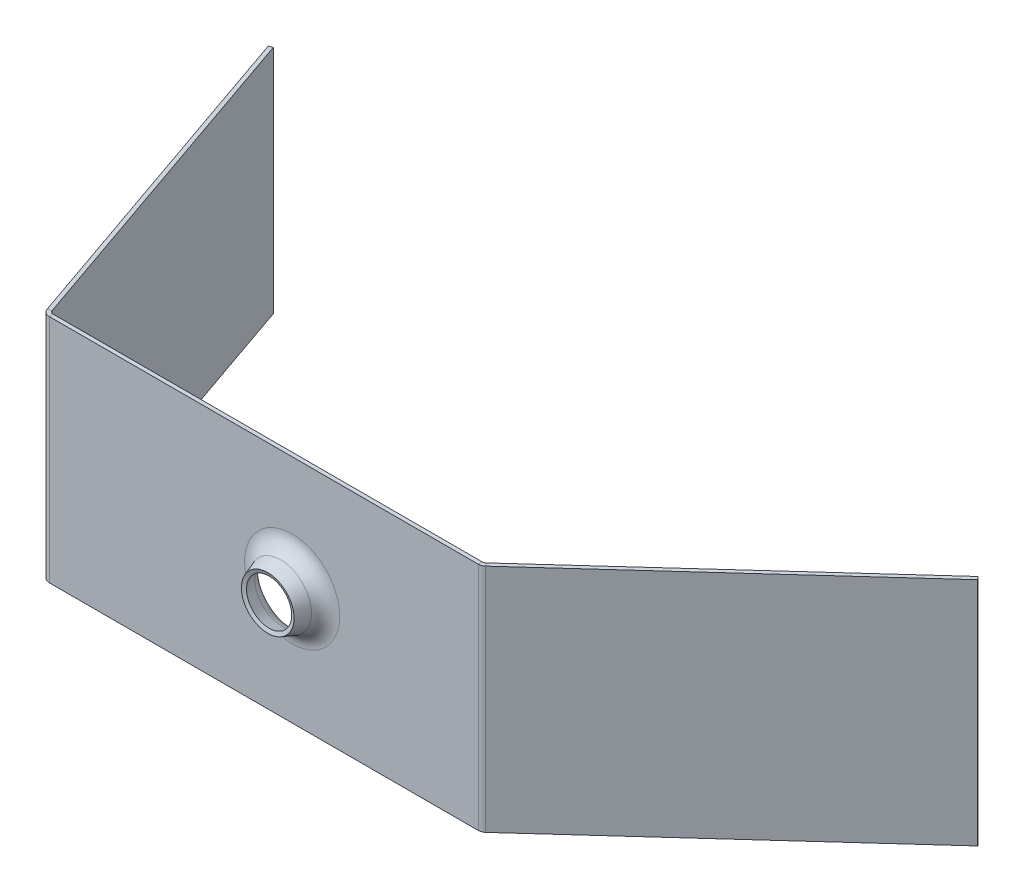
ISO-10303-21;
HEADER;
FILE_DESCRIPTION(('STEP AP214'),'2;1');
FILE_NAME('part.step','',(''),(''),'','','');
FILE_SCHEMA(('AUTOMOTIVE_DESIGN { 1 0 10303 214 1 1 1 1 }'));
ENDSEC;
DATA;
#1=APPLICATION_CONTEXT('core data for automotive mechanical design processes');
#2=APPLICATION_PROTOCOL_DEFINITION('international standard','automotive_design',2000,#1);
#3=PRODUCT_CONTEXT('',#1,'mechanical');
#4=PRODUCT('Part','Part','',(#3));
#5=PRODUCT_RELATED_PRODUCT_CATEGORY('part','',(#4));
#6=PRODUCT_DEFINITION_FORMATION('','',#4);
#7=PRODUCT_DEFINITION_CONTEXT('part definition',#1,'design');
#8=PRODUCT_DEFINITION('design','',#6,#7);
#9=PRODUCT_DEFINITION_SHAPE('','',#8);
#10=(LENGTH_UNIT() NAMED_UNIT(*) SI_UNIT(.MILLI.,.METRE.));
#11=(NAMED_UNIT(*) PLANE_ANGLE_UNIT() SI_UNIT($,.RADIAN.));
#12=(NAMED_UNIT(*) SI_UNIT($,.STERADIAN.) SOLID_ANGLE_UNIT());
#13=UNCERTAINTY_MEASURE_WITH_UNIT(LENGTH_MEASURE(1.E-05),#10,'distance_accuracy_value','');
#14=(GEOMETRIC_REPRESENTATION_CONTEXT(3) GLOBAL_UNCERTAINTY_ASSIGNED_CONTEXT((#13)) GLOBAL_UNIT_ASSIGNED_CONTEXT((#10,
#11,#12)) REPRESENTATION_CONTEXT('',''));
#15=CARTESIAN_POINT('',(0.,0.,0.));
#16=DIRECTION('',(0.,0.,1.));
#17=DIRECTION('',(1.,0.,0.));
#18=AXIS2_PLACEMENT_3D('',#15,#16,#17);
#19=CARTESIAN_POINT('',(0.,42.7,0.7366));
#20=DIRECTION('',(0.,0.,-1.));
#21=DIRECTION('',(-1.,0.,0.));
#22=AXIS2_PLACEMENT_3D('',#19,#20,#21);
#23=PLANE('',#22);
#24=DIRECTION('',(1.,0.,0.));
#25=VECTOR('',#24,1.);
#26=CARTESIAN_POINT('',(0.,0.,0.7366));
#27=LINE('',#26,#25);
#28=CARTESIAN_POINT('',(0.52431676148833,0.,0.7366));
#29=VERTEX_POINT('',#28);
#30=CARTESIAN_POINT('',(79.9649967682891,0.,0.736600000000012));
#31=VERTEX_POINT('',#30);
#32=EDGE_CURVE('E202',#29,#31,#27,.T.);
#33=ORIENTED_EDGE('',*,*,#32,.T.);
#34=DIRECTION('',(0.,-1.,0.));
#35=VECTOR('',#34,1.);
#36=CARTESIAN_POINT('',(79.9649967682891,42.7,0.736600000000012));
#37=LINE('',#36,#35);
#38=CARTESIAN_POINT('',(79.9649967682891,42.7,0.736600000000012));
#39=VERTEX_POINT('',#38);
#40=EDGE_CURVE('E164',#39,#31,#37,.T.);
#41=ORIENTED_EDGE('',*,*,#40,.F.);
#42=DIRECTION('',(1.,0.,0.));
#43=VECTOR('',#42,1.);
#44=CARTESIAN_POINT('',(0.,42.7,0.7366));
#45=LINE('',#44,#43);
#46=CARTESIAN_POINT('',(0.52431676148833,42.7,0.7366));
#47=VERTEX_POINT('',#46);
#48=EDGE_CURVE('E139',#47,#39,#45,.T.);
#49=ORIENTED_EDGE('',*,*,#48,.F.);
#50=DIRECTION('',(0.,-1.,0.));
#51=VECTOR('',#50,1.);
#52=CARTESIAN_POINT('',(0.52431676148833,42.7,0.7366));
#53=LINE('',#52,#51);
#54=EDGE_CURVE('E158',#47,#29,#53,.T.);
#55=ORIENTED_EDGE('',*,*,#54,.T.);
#56=EDGE_LOOP('',(#33,#41,#49,#55));
#57=FACE_BOUND('',#56,.T.);
#58=CARTESIAN_POINT('',(45.4934012407193,21.5147863199832,0.7366));
#59=DIRECTION('',(0.,0.,1.));
#60=DIRECTION('',(1.,0.,0.));
#61=AXIS2_PLACEMENT_3D('',#58,#59,#60);
#62=CIRCLE('',#61,8.80083015283884);
#63=CARTESIAN_POINT('',(54.2942313935582,21.5147863199832,0.7366));
#64=VERTEX_POINT('',#63);
#65=EDGE_CURVE('E11',#64,#64,#62,.T.);
#66=ORIENTED_EDGE('',*,*,#65,.F.);
#67=EDGE_LOOP('',(#66));
#68=FACE_BOUND('',#67,.T.);
#69=ADVANCED_FACE('F37',(#57,#68),#23,.F.);
#70=CARTESIAN_POINT('',(0.,42.7,0.));
#71=DIRECTION('',(0.,0.,-1.));
#72=DIRECTION('',(-1.,0.,0.));
#73=AXIS2_PLACEMENT_3D('',#70,#71,#72);
#74=PLANE('',#73);
#75=DIRECTION('',(1.,0.,0.));
#76=VECTOR('',#75,1.);
#77=CARTESIAN_POINT('',(0.,0.,0.));
#78=LINE('',#77,#76);
#79=CARTESIAN_POINT('',(0.52431676148833,0.,0.));
#80=VERTEX_POINT('',#79);
#81=CARTESIAN_POINT('',(79.9649967682891,0.,0.));
#82=VERTEX_POINT('',#81);
#83=EDGE_CURVE('E187',#80,#82,#78,.T.);
#84=ORIENTED_EDGE('',*,*,#83,.F.);
#85=DIRECTION('',(0.,-1.,0.));
#86=VECTOR('',#85,1.);
#87=CARTESIAN_POINT('',(0.52431676148833,42.7,0.));
#88=LINE('',#87,#86);
#89=CARTESIAN_POINT('',(0.52431676148833,42.7,0.));
#90=VERTEX_POINT('',#89);
#91=EDGE_CURVE('E217',#90,#80,#88,.T.);
#92=ORIENTED_EDGE('',*,*,#91,.F.);
#93=DIRECTION('',(1.,0.,0.));
#94=VECTOR('',#93,1.);
#95=CARTESIAN_POINT('',(0.,42.7,0.));
#96=LINE('',#95,#94);
#97=CARTESIAN_POINT('',(79.9649967682891,42.7,0.));
#98=VERTEX_POINT('',#97);
#99=EDGE_CURVE('E142',#90,#98,#96,.T.);
#100=ORIENTED_EDGE('',*,*,#99,.T.);
#101=DIRECTION('',(0.,-1.,0.));
#102=VECTOR('',#101,1.);
#103=CARTESIAN_POINT('',(79.9649967682891,42.7,0.));
#104=LINE('',#103,#102);
#105=EDGE_CURVE('E220',#98,#82,#104,.T.);
#106=ORIENTED_EDGE('',*,*,#105,.T.);
#107=EDGE_LOOP('',(#84,#92,#100,#106));
#108=FACE_BOUND('',#107,.T.);
#109=CARTESIAN_POINT('',(45.4934012407193,21.5147863199832,0.));
#110=DIRECTION('',(0.,0.,1.));
#111=DIRECTION('',(0.,-1.,0.));
#112=AXIS2_PLACEMENT_3D('',#109,#110,#111);
#113=CIRCLE('',#112,8.80083015283884);
#114=CARTESIAN_POINT('',(45.4934012407193,12.7139561671443,0.));
#115=VERTEX_POINT('',#114);
#116=EDGE_CURVE('E179',#115,#115,#113,.F.);
#117=ORIENTED_EDGE('',*,*,#116,.F.);
#118=EDGE_LOOP('',(#117));
#119=FACE_BOUND('',#118,.T.);
#120=ADVANCED_FACE('F312',(#108,#119),#74,.T.);
#121=CARTESIAN_POINT('',(0.52431676148833,42.7,0.));
#122=DIRECTION('',(0.,1.,0.));
#123=DIRECTION('',(0.,0.,1.));
#124=AXIS2_PLACEMENT_3D('',#121,#122,#123);
#125=PLANE('',#124);
#126=DIRECTION('',(0.,0.,1.));
#127=VECTOR('',#126,1.);
#128=CARTESIAN_POINT('',(0.52431676148833,42.7,0.));
#129=LINE('',#128,#127);
#130=EDGE_CURVE('E46',#90,#47,#129,.T.);
#131=ORIENTED_EDGE('',*,*,#130,.F.);
#132=CARTESIAN_POINT('',(0.524316761488331,42.7,-0.7366));
#133=DIRECTION('',(0.,-1.,0.));
#134=DIRECTION('',(0.,0.,-1.));
#135=AXIS2_PLACEMENT_3D('',#132,#133,#134);
#136=CIRCLE('',#135,0.7366);
#137=CARTESIAN_POINT('',(-0.17167801218071,42.7,-0.495413692292907));
#138=VERTEX_POINT('',#137);
#139=EDGE_CURVE('E252',#138,#90,#136,.F.);
#140=ORIENTED_EDGE('',*,*,#139,.F.);
#141=DIRECTION('',(0.944874794554766,0.,-0.327431859499176));
#142=VECTOR('',#141,1.);
#143=CARTESIAN_POINT('',(-0.867672785849751,42.7,-0.254227384585814));
#144=LINE('',#143,#142);
#145=CARTESIAN_POINT('',(-0.867672785849751,42.7,-0.254227384585814));
#146=VERTEX_POINT('',#145);
#147=EDGE_CURVE('E147',#146,#138,#144,.T.);
#148=ORIENTED_EDGE('',*,*,#147,.F.);
#149=CARTESIAN_POINT('',(0.524316761488331,42.7,-0.7366));
#150=DIRECTION('',(0.,1.,0.));
#151=DIRECTION('',(1.,0.,0.));
#152=AXIS2_PLACEMENT_3D('',#149,#150,#151);
#153=CIRCLE('',#152,1.4732);
#154=EDGE_CURVE('E149',#146,#47,#153,.T.);
#155=ORIENTED_EDGE('',*,*,#154,.T.);
#156=EDGE_LOOP('',(#131,#140,#148,#155));
#157=FACE_BOUND('',#156,.T.);
#158=ADVANCED_FACE('F39',(#157),#125,.T.);
#159=CARTESIAN_POINT('',(-0.867672785849751,42.7,-0.254227384585814));
#160=DIRECTION('',(0.,1.,0.));
#161=DIRECTION('',(0.,0.,1.));
#162=AXIS2_PLACEMENT_3D('',#159,#160,#161);
#163=PLANE('',#162);
#164=ORIENTED_EDGE('',*,*,#99,.F.);
#165=ORIENTED_EDGE('',*,*,#130,.T.);
#166=ORIENTED_EDGE('',*,*,#48,.T.);
#167=DIRECTION('',(0.,0.,-1.));
#168=VECTOR('',#167,1.);
#169=CARTESIAN_POINT('',(79.9649967682891,42.7,0.736600000000012));
#170=LINE('',#169,#168);
#171=EDGE_CURVE('E232',#39,#98,#170,.T.);
#172=ORIENTED_EDGE('',*,*,#171,.T.);
#173=EDGE_LOOP('',(#164,#165,#166,#172));
#174=FACE_BOUND('',#173,.T.);
#175=ADVANCED_FACE('F137',(#174),#163,.T.);
#176=CARTESIAN_POINT('',(-0.17167801218071,0.,-0.495413692292907));
#177=DIRECTION('',(0.,-1.,0.));
#178=DIRECTION('',(0.,0.,-1.));
#179=AXIS2_PLACEMENT_3D('',#176,#177,#178);
#180=PLANE('',#179);
#181=DIRECTION('',(-0.944874794554766,0.,0.327431859499176));
#182=VECTOR('',#181,1.);
#183=CARTESIAN_POINT('',(-0.17167801218071,0.,-0.495413692292907));
#184=LINE('',#183,#182);
#185=CARTESIAN_POINT('',(-0.17167801218071,0.,-0.495413692292907));
#186=VERTEX_POINT('',#185);
#187=CARTESIAN_POINT('',(-0.867672785849751,0.,-0.254227384585814));
#188=VERTEX_POINT('',#187);
#189=EDGE_CURVE('E237',#186,#188,#184,.T.);
#190=ORIENTED_EDGE('',*,*,#189,.F.);
#191=CARTESIAN_POINT('',(0.524316761488331,0.,-0.7366));
#192=DIRECTION('',(0.,-1.,0.));
#193=DIRECTION('',(0.,0.,-1.));
#194=AXIS2_PLACEMENT_3D('',#191,#192,#193);
#195=CIRCLE('',#194,0.7366);
#196=EDGE_CURVE('E189',#186,#80,#195,.F.);
#197=ORIENTED_EDGE('',*,*,#196,.T.);
#198=DIRECTION('',(0.,0.,-1.));
#199=VECTOR('',#198,1.);
#200=CARTESIAN_POINT('',(0.52431676148833,0.,0.7366));
#201=LINE('',#200,#199);
#202=EDGE_CURVE('E235',#29,#80,#201,.T.);
#203=ORIENTED_EDGE('',*,*,#202,.F.);
#204=CARTESIAN_POINT('',(0.524316761488331,0.,-0.7366));
#205=DIRECTION('',(0.,1.,0.));
#206=DIRECTION('',(1.,0.,0.));
#207=AXIS2_PLACEMENT_3D('',#204,#205,#206);
#208=CIRCLE('',#207,1.4732);
#209=EDGE_CURVE('E161',#188,#29,#208,.T.);
#210=ORIENTED_EDGE('',*,*,#209,.F.);
#211=EDGE_LOOP('',(#190,#197,#203,#210));
#212=FACE_BOUND('',#211,.T.);
#213=ADVANCED_FACE('F369',(#212),#180,.T.);
#214=CARTESIAN_POINT('',(0.52431676148833,0.,0.7366));
#215=DIRECTION('',(0.,-1.,0.));
#216=DIRECTION('',(0.,0.,-1.));
#217=AXIS2_PLACEMENT_3D('',#214,#215,#216);
#218=PLANE('',#217);
#219=DIRECTION('',(0.327431859499176,0.,0.944874794554766));
#220=VECTOR('',#219,1.);
#221=CARTESIAN_POINT('',(0.,0.,0.));
#222=LINE('',#221,#220);
#223=CARTESIAN_POINT('',(-21.8862762988102,0.,-63.1575401765666));
#224=VERTEX_POINT('',#223);
#225=EDGE_CURVE('E192',#224,#186,#222,.T.);
#226=ORIENTED_EDGE('',*,*,#225,.T.);
#227=ORIENTED_EDGE('',*,*,#189,.T.);
#228=DIRECTION('',(0.327431859499176,0.,0.944874794554766));
#229=VECTOR('',#228,1.);
#230=CARTESIAN_POINT('',(-0.695994773669041,0.,0.241186307707093));
#231=LINE('',#230,#229);
#232=CARTESIAN_POINT('',(-22.5822710724792,0.,-62.9163538688595));
#233=VERTEX_POINT('',#232);
#234=EDGE_CURVE('E198',#233,#188,#231,.T.);
#235=ORIENTED_EDGE('',*,*,#234,.F.);
#236=DIRECTION('',(0.944874794554775,0.,-0.32743185949915));
#237=VECTOR('',#236,1.);
#238=CARTESIAN_POINT('',(-22.5822710724792,0.,-62.9163538688595));
#239=LINE('',#238,#237);
#240=EDGE_CURVE('E195',#233,#224,#239,.T.);
#241=ORIENTED_EDGE('',*,*,#240,.T.);
#242=EDGE_LOOP('',(#226,#227,#235,#241));
#243=FACE_BOUND('',#242,.T.);
#244=ADVANCED_FACE('F365',(#243),#218,.T.);
#245=CARTESIAN_POINT('',(80.4603695627473,42.7,-0.191452905620188));
#246=DIRECTION('',(0.,1.,0.));
#247=DIRECTION('',(0.,0.,1.));
#248=AXIS2_PLACEMENT_3D('',#245,#246,#247);
#249=PLANE('',#248);
#250=DIRECTION('',(0.672512618053419,0.,0.740085656231045));
#251=VECTOR('',#250,1.);
#252=CARTESIAN_POINT('',(80.4603695627473,42.7,-0.191452905620188));
#253=LINE('',#252,#251);
#254=CARTESIAN_POINT('',(80.4603695627473,42.7,-0.191452905620188));
#255=VERTEX_POINT('',#254);
#256=CARTESIAN_POINT('',(80.9557423572055,42.7,0.353694188759597));
#257=VERTEX_POINT('',#256);
#258=EDGE_CURVE('E54',#255,#257,#253,.T.);
#259=ORIENTED_EDGE('',*,*,#258,.F.);
#260=CARTESIAN_POINT('',(79.9649967682892,42.7,-0.736599999999988));
#261=DIRECTION('',(0.,-1.,0.));
#262=DIRECTION('',(0.,0.,-1.));
#263=AXIS2_PLACEMENT_3D('',#260,#261,#262);
#264=CIRCLE('',#263,0.7366);
#265=EDGE_CURVE('E262',#98,#255,#264,.F.);
#266=ORIENTED_EDGE('',*,*,#265,.F.);
#267=ORIENTED_EDGE('',*,*,#171,.F.);
#268=CARTESIAN_POINT('',(79.9649967682892,42.7,-0.736599999999988));
#269=DIRECTION('',(0.,1.,0.));
#270=DIRECTION('',(1.,0.,0.));
#271=AXIS2_PLACEMENT_3D('',#268,#269,#270);
#272=CIRCLE('',#271,1.4732);
#273=EDGE_CURVE('E169',#39,#257,#272,.T.);
#274=ORIENTED_EDGE('',*,*,#273,.T.);
#275=EDGE_LOOP('',(#259,#266,#267,#274));
#276=FACE_BOUND('',#275,.T.);
#277=ADVANCED_FACE('F362',(#276),#249,.T.);
#278=CARTESIAN_POINT('',(79.9649967682891,42.7,0.736600000000012));
#279=DIRECTION('',(0.,1.,0.));
#280=DIRECTION('',(0.,0.,1.));
#281=AXIS2_PLACEMENT_3D('',#278,#279,#280);
#282=PLANE('',#281);
#283=DIRECTION('',(0.740085656231041,0.,-0.672512618053424));
#284=VECTOR('',#283,1.);
#285=CARTESIAN_POINT('',(80.2496797623041,42.7,0.));
#286=LINE('',#285,#284);
#287=CARTESIAN_POINT('',(128.191046893031,42.7,-43.564111870965));
#288=VERTEX_POINT('',#287);
#289=EDGE_CURVE('E265',#255,#288,#286,.T.);
#290=ORIENTED_EDGE('',*,*,#289,.F.);
#291=ORIENTED_EDGE('',*,*,#258,.T.);
#292=DIRECTION('',(0.740085656231041,0.,-0.672512618053424));
#293=VECTOR('',#292,1.);
#294=CARTESIAN_POINT('',(80.7450525567622,42.7,0.545147094379784));
#295=LINE('',#294,#293);
#296=CARTESIAN_POINT('',(128.686419687489,42.7,-43.0189647765853));
#297=VERTEX_POINT('',#296);
#298=EDGE_CURVE('E108',#257,#297,#295,.T.);
#299=ORIENTED_EDGE('',*,*,#298,.T.);
#300=DIRECTION('',(0.672512618053439,0.,0.740085656231027));
#301=VECTOR('',#300,1.);
#302=CARTESIAN_POINT('',(128.191046893031,42.7,-43.564111870965));
#303=LINE('',#302,#301);
#304=EDGE_CURVE('E268',#288,#297,#303,.T.);
#305=ORIENTED_EDGE('',*,*,#304,.F.);
#306=EDGE_LOOP('',(#290,#291,#299,#305));
#307=FACE_BOUND('',#306,.T.);
#308=ADVANCED_FACE('F359',(#307),#282,.T.);
#309=CARTESIAN_POINT('',(79.9649967682891,0.,0.));
#310=DIRECTION('',(0.,-1.,0.));
#311=DIRECTION('',(0.,0.,-1.));
#312=AXIS2_PLACEMENT_3D('',#309,#310,#311);
#313=PLANE('',#312);
#314=DIRECTION('',(0.,0.,1.));
#315=VECTOR('',#314,1.);
#316=CARTESIAN_POINT('',(79.9649967682891,0.,0.));
#317=LINE('',#316,#315);
#318=EDGE_CURVE('E95',#82,#31,#317,.T.);
#319=ORIENTED_EDGE('',*,*,#318,.F.);
#320=CARTESIAN_POINT('',(79.9649967682892,0.,-0.736599999999988));
#321=DIRECTION('',(0.,-1.,0.));
#322=DIRECTION('',(0.,0.,-1.));
#323=AXIS2_PLACEMENT_3D('',#320,#321,#322);
#324=CIRCLE('',#323,0.7366);
#325=CARTESIAN_POINT('',(80.4603695627473,0.,-0.191452905620188));
#326=VERTEX_POINT('',#325);
#327=EDGE_CURVE('E185',#82,#326,#324,.F.);
#328=ORIENTED_EDGE('',*,*,#327,.T.);
#329=DIRECTION('',(-0.672512618053419,0.,-0.740085656231045));
#330=VECTOR('',#329,1.);
#331=CARTESIAN_POINT('',(80.9557423572055,0.,0.353694188759597));
#332=LINE('',#331,#330);
#333=CARTESIAN_POINT('',(80.9557423572055,0.,0.353694188759597));
#334=VERTEX_POINT('',#333);
#335=EDGE_CURVE('E102',#334,#326,#332,.T.);
#336=ORIENTED_EDGE('',*,*,#335,.F.);
#337=CARTESIAN_POINT('',(79.9649967682892,0.,-0.736599999999988));
#338=DIRECTION('',(0.,1.,0.));
#339=DIRECTION('',(1.,0.,0.));
#340=AXIS2_PLACEMENT_3D('',#337,#338,#339);
#341=CIRCLE('',#340,1.4732);
#342=EDGE_CURVE('E204',#31,#334,#341,.T.);
#343=ORIENTED_EDGE('',*,*,#342,.F.);
#344=EDGE_LOOP('',(#319,#328,#336,#343));
#345=FACE_BOUND('',#344,.T.);
#346=ADVANCED_FACE('F356',(#345),#313,.T.);
#347=CARTESIAN_POINT('',(80.9557423572055,0.,0.353694188759597));
#348=DIRECTION('',(0.,-1.,0.));
#349=DIRECTION('',(0.,0.,-1.));
#350=AXIS2_PLACEMENT_3D('',#347,#348,#349);
#351=PLANE('',#350);
#352=ORIENTED_EDGE('',*,*,#83,.T.);
#353=ORIENTED_EDGE('',*,*,#318,.T.);
#354=ORIENTED_EDGE('',*,*,#32,.F.);
#355=ORIENTED_EDGE('',*,*,#202,.T.);
#356=EDGE_LOOP('',(#352,#353,#354,#355));
#357=FACE_BOUND('',#356,.T.);
#358=ADVANCED_FACE('F352',(#357),#351,.T.);
#359=CARTESIAN_POINT('',(80.7450525567622,42.7,0.545147094379784));
#360=DIRECTION('',(-0.672512618053424,0.,-0.740085656231041));
#361=DIRECTION('',(-0.740085656231041,0.,0.672512618053424));
#362=AXIS2_PLACEMENT_3D('',#359,#360,#361);
#363=PLANE('',#362);
#364=DIRECTION('',(0.740085656231041,0.,-0.672512618053424));
#365=VECTOR('',#364,1.);
#366=CARTESIAN_POINT('',(80.7450525567622,0.,0.545147094379784));
#367=LINE('',#366,#365);
#368=CARTESIAN_POINT('',(128.686419687489,0.,-43.0189647765853));
#369=VERTEX_POINT('',#368);
#370=EDGE_CURVE('E175',#334,#369,#367,.T.);
#371=ORIENTED_EDGE('',*,*,#370,.T.);
#372=DIRECTION('',(0.,-1.,0.));
#373=VECTOR('',#372,1.);
#374=CARTESIAN_POINT('',(128.686419687489,42.7,-43.0189647765853));
#375=LINE('',#374,#373);
#376=EDGE_CURVE('E228',#297,#369,#375,.T.);
#377=ORIENTED_EDGE('',*,*,#376,.F.);
#378=ORIENTED_EDGE('',*,*,#298,.F.);
#379=DIRECTION('',(0.,-1.,0.));
#380=VECTOR('',#379,1.);
#381=CARTESIAN_POINT('',(80.9557423572055,42.7,0.353694188759597));
#382=LINE('',#381,#380);
#383=EDGE_CURVE('E171',#257,#334,#382,.T.);
#384=ORIENTED_EDGE('',*,*,#383,.T.);
#385=EDGE_LOOP('',(#371,#377,#378,#384));
#386=FACE_BOUND('',#385,.T.);
#387=ADVANCED_FACE('F348',(#386),#363,.F.);
#388=CARTESIAN_POINT('',(128.191046893031,42.7,-43.564111870965));
#389=DIRECTION('',(0.740085656231027,0.,-0.672512618053439));
#390=DIRECTION('',(-0.672512618053439,0.,-0.740085656231027));
#391=AXIS2_PLACEMENT_3D('',#388,#389,#390);
#392=PLANE('',#391);
#393=DIRECTION('',(0.672512618053439,0.,0.740085656231027));
#394=VECTOR('',#393,1.);
#395=CARTESIAN_POINT('',(128.191046893031,0.,-43.564111870965));
#396=LINE('',#395,#394);
#397=CARTESIAN_POINT('',(128.191046893031,0.,-43.564111870965));
#398=VERTEX_POINT('',#397);
#399=EDGE_CURVE('E178',#398,#369,#396,.T.);
#400=ORIENTED_EDGE('',*,*,#399,.F.);
#401=DIRECTION('',(0.,-1.,0.));
#402=VECTOR('',#401,1.);
#403=CARTESIAN_POINT('',(128.191046893031,42.7,-43.564111870965));
#404=LINE('',#403,#402);
#405=EDGE_CURVE('E226',#288,#398,#404,.T.);
#406=ORIENTED_EDGE('',*,*,#405,.F.);
#407=ORIENTED_EDGE('',*,*,#304,.T.);
#408=ORIENTED_EDGE('',*,*,#376,.T.);
#409=EDGE_LOOP('',(#400,#406,#407,#408));
#410=FACE_BOUND('',#409,.T.);
#411=ADVANCED_FACE('F344',(#410),#392,.T.);
#412=CARTESIAN_POINT('',(80.2496797623041,42.7,0.));
#413=DIRECTION('',(-0.672512618053424,0.,-0.740085656231041));
#414=DIRECTION('',(-0.740085656231041,0.,0.672512618053424));
#415=AXIS2_PLACEMENT_3D('',#412,#413,#414);
#416=PLANE('',#415);
#417=DIRECTION('',(0.740085656231041,0.,-0.672512618053424));
#418=VECTOR('',#417,1.);
#419=CARTESIAN_POINT('',(80.2496797623041,0.,0.));
#420=LINE('',#419,#418);
#421=EDGE_CURVE('E182',#326,#398,#420,.T.);
#422=ORIENTED_EDGE('',*,*,#421,.F.);
#423=DIRECTION('',(0.,-1.,0.));
#424=VECTOR('',#423,1.);
#425=CARTESIAN_POINT('',(80.4603695627473,42.7,-0.191452905620188));
#426=LINE('',#425,#424);
#427=EDGE_CURVE('E223',#255,#326,#426,.T.);
#428=ORIENTED_EDGE('',*,*,#427,.F.);
#429=ORIENTED_EDGE('',*,*,#289,.T.);
#430=ORIENTED_EDGE('',*,*,#405,.T.);
#431=EDGE_LOOP('',(#422,#428,#429,#430));
#432=FACE_BOUND('',#431,.T.);
#433=ADVANCED_FACE('F340',(#432),#416,.T.);
#434=CARTESIAN_POINT('',(79.9649967682892,42.7,-0.736599999999988));
#435=DIRECTION('',(0.,-1.,0.));
#436=DIRECTION('',(0.,0.,-1.));
#437=AXIS2_PLACEMENT_3D('',#434,#435,#436);
#438=CYLINDRICAL_SURFACE('',#437,0.7366);
#439=ORIENTED_EDGE('',*,*,#327,.F.);
#440=ORIENTED_EDGE('',*,*,#105,.F.);
#441=ORIENTED_EDGE('',*,*,#265,.T.);
#442=ORIENTED_EDGE('',*,*,#427,.T.);
#443=EDGE_LOOP('',(#439,#440,#441,#442));
#444=FACE_BOUND('',#443,.T.);
#445=ADVANCED_FACE('F336',(#444),#438,.F.);
#446=CARTESIAN_POINT('',(0.524316761488331,42.7,-0.7366));
#447=DIRECTION('',(0.,-1.,0.));
#448=DIRECTION('',(0.,0.,-1.));
#449=AXIS2_PLACEMENT_3D('',#446,#447,#448);
#450=CYLINDRICAL_SURFACE('',#449,0.7366);
#451=ORIENTED_EDGE('',*,*,#196,.F.);
#452=DIRECTION('',(0.,-1.,0.));
#453=VECTOR('',#452,1.);
#454=CARTESIAN_POINT('',(-0.17167801218071,42.7,-0.495413692292907));
#455=LINE('',#454,#453);
#456=EDGE_CURVE('E214',#138,#186,#455,.T.);
#457=ORIENTED_EDGE('',*,*,#456,.F.);
#458=ORIENTED_EDGE('',*,*,#139,.T.);
#459=ORIENTED_EDGE('',*,*,#91,.T.);
#460=EDGE_LOOP('',(#451,#457,#458,#459));
#461=FACE_BOUND('',#460,.T.);
#462=ADVANCED_FACE('F251',(#461),#450,.F.);
#463=CARTESIAN_POINT('',(0.,42.7,0.));
#464=DIRECTION('',(0.944874794554766,0.,-0.327431859499176));
#465=DIRECTION('',(-0.327431859499176,0.,-0.944874794554766));
#466=AXIS2_PLACEMENT_3D('',#463,#464,#465);
#467=PLANE('',#466);
#468=ORIENTED_EDGE('',*,*,#225,.F.);
#469=DIRECTION('',(0.,-1.,0.));
#470=VECTOR('',#469,1.);
#471=CARTESIAN_POINT('',(-21.8862762988102,42.7,-63.1575401765666));
#472=LINE('',#471,#470);
#473=CARTESIAN_POINT('',(-21.8862762988102,42.7,-63.1575401765666));
#474=VERTEX_POINT('',#473);
#475=EDGE_CURVE('E212',#474,#224,#472,.T.);
#476=ORIENTED_EDGE('',*,*,#475,.F.);
#477=DIRECTION('',(0.327431859499176,0.,0.944874794554766));
#478=VECTOR('',#477,1.);
#479=CARTESIAN_POINT('',(0.,42.7,0.));
#480=LINE('',#479,#478);
#481=EDGE_CURVE('E245',#474,#138,#480,.T.);
#482=ORIENTED_EDGE('',*,*,#481,.T.);
#483=ORIENTED_EDGE('',*,*,#456,.T.);
#484=EDGE_LOOP('',(#468,#476,#482,#483));
#485=FACE_BOUND('',#484,.T.);
#486=ADVANCED_FACE('F256',(#485),#467,.T.);
#487=CARTESIAN_POINT('',(-22.5822710724792,42.7,-62.9163538688595));
#488=DIRECTION('',(-0.32743185949915,0.,-0.944874794554775));
#489=DIRECTION('',(-0.944874794554775,0.,0.32743185949915));
#490=AXIS2_PLACEMENT_3D('',#487,#488,#489);
#491=PLANE('',#490);
#492=ORIENTED_EDGE('',*,*,#240,.F.);
#493=DIRECTION('',(0.,-1.,0.));
#494=VECTOR('',#493,1.);
#495=CARTESIAN_POINT('',(-22.5822710724792,42.7,-62.9163538688595));
#496=LINE('',#495,#494);
#497=CARTESIAN_POINT('',(-22.5822710724792,42.7,-62.9163538688595));
#498=VERTEX_POINT('',#497);
#499=EDGE_CURVE('E210',#498,#233,#496,.T.);
#500=ORIENTED_EDGE('',*,*,#499,.F.);
#501=DIRECTION('',(0.944874794554775,0.,-0.32743185949915));
#502=VECTOR('',#501,1.);
#503=CARTESIAN_POINT('',(-22.5822710724792,42.7,-62.9163538688595));
#504=LINE('',#503,#502);
#505=EDGE_CURVE('E257',#498,#474,#504,.T.);
#506=ORIENTED_EDGE('',*,*,#505,.T.);
#507=ORIENTED_EDGE('',*,*,#475,.T.);
#508=EDGE_LOOP('',(#492,#500,#506,#507));
#509=FACE_BOUND('',#508,.T.);
#510=ADVANCED_FACE('F328',(#509),#491,.T.);
#511=CARTESIAN_POINT('',(-0.695994773669041,42.7,0.241186307707093));
#512=DIRECTION('',(0.944874794554766,0.,-0.327431859499176));
#513=DIRECTION('',(-0.327431859499176,0.,-0.944874794554766));
#514=AXIS2_PLACEMENT_3D('',#511,#512,#513);
#515=PLANE('',#514);
#516=ORIENTED_EDGE('',*,*,#234,.T.);
#517=DIRECTION('',(0.,-1.,0.));
#518=VECTOR('',#517,1.);
#519=CARTESIAN_POINT('',(-0.867672785849751,42.7,-0.254227384585814));
#520=LINE('',#519,#518);
#521=EDGE_CURVE('E163',#146,#188,#520,.T.);
#522=ORIENTED_EDGE('',*,*,#521,.F.);
#523=DIRECTION('',(0.327431859499176,0.,0.944874794554766));
#524=VECTOR('',#523,1.);
#525=CARTESIAN_POINT('',(-0.695994773669041,42.7,0.241186307707093));
#526=LINE('',#525,#524);
#527=EDGE_CURVE('E154',#498,#146,#526,.T.);
#528=ORIENTED_EDGE('',*,*,#527,.F.);
#529=ORIENTED_EDGE('',*,*,#499,.T.);
#530=EDGE_LOOP('',(#516,#522,#528,#529));
#531=FACE_BOUND('',#530,.T.);
#532=ADVANCED_FACE('F325',(#531),#515,.F.);
#533=CARTESIAN_POINT('',(0.524316761488331,42.7,-0.7366));
#534=DIRECTION('',(0.,-1.,0.));
#535=DIRECTION('',(0.,0.,-1.));
#536=AXIS2_PLACEMENT_3D('',#533,#534,#535);
#537=CYLINDRICAL_SURFACE('',#536,1.4732);
#538=ORIENTED_EDGE('',*,*,#209,.T.);
#539=ORIENTED_EDGE('',*,*,#54,.F.);
#540=ORIENTED_EDGE('',*,*,#154,.F.);
#541=ORIENTED_EDGE('',*,*,#521,.T.);
#542=EDGE_LOOP('',(#538,#539,#540,#541));
#543=FACE_BOUND('',#542,.T.);
#544=ADVANCED_FACE('F159',(#543),#537,.T.);
#545=CARTESIAN_POINT('',(79.9649967682892,42.7,-0.736599999999988));
#546=DIRECTION('',(0.,-1.,0.));
#547=DIRECTION('',(0.,0.,-1.));
#548=AXIS2_PLACEMENT_3D('',#545,#546,#547);
#549=CYLINDRICAL_SURFACE('',#548,1.4732);
#550=ORIENTED_EDGE('',*,*,#342,.T.);
#551=ORIENTED_EDGE('',*,*,#383,.F.);
#552=ORIENTED_EDGE('',*,*,#273,.F.);
#553=ORIENTED_EDGE('',*,*,#40,.T.);
#554=EDGE_LOOP('',(#550,#551,#552,#553));
#555=FACE_BOUND('',#554,.T.);
#556=ADVANCED_FACE('F321',(#555),#549,.T.);
#557=CARTESIAN_POINT('',(79.9649967682892,42.7,-0.736599999999988));
#558=DIRECTION('',(0.,-1.,0.));
#559=DIRECTION('',(-1.,0.,0.));
#560=AXIS2_PLACEMENT_3D('',#557,#558,#559);
#561=PLANE('',#560);
#562=ORIENTED_EDGE('',*,*,#527,.T.);
#563=ORIENTED_EDGE('',*,*,#147,.T.);
#564=ORIENTED_EDGE('',*,*,#481,.F.);
#565=ORIENTED_EDGE('',*,*,#505,.F.);
#566=EDGE_LOOP('',(#562,#563,#564,#565));
#567=FACE_BOUND('',#566,.T.);
#568=ADVANCED_FACE('F242',(#567),#561,.F.);
#569=CARTESIAN_POINT('',(79.9649967682892,0.,-0.736599999999988));
#570=DIRECTION('',(0.,-1.,0.));
#571=DIRECTION('',(-1.,0.,0.));
#572=AXIS2_PLACEMENT_3D('',#569,#570,#571);
#573=PLANE('',#572);
#574=ORIENTED_EDGE('',*,*,#370,.F.);
#575=ORIENTED_EDGE('',*,*,#335,.T.);
#576=ORIENTED_EDGE('',*,*,#421,.T.);
#577=ORIENTED_EDGE('',*,*,#399,.T.);
#578=EDGE_LOOP('',(#574,#575,#576,#577));
#579=FACE_BOUND('',#578,.T.);
#580=ADVANCED_FACE('F397',(#579),#573,.T.);
#581=CARTESIAN_POINT('',(45.4934012407193,21.5147863199832,4.));
#582=DIRECTION('',(0.,0.,1.));
#583=DIRECTION('',(0.,-1.,0.));
#584=AXIS2_PLACEMENT_3D('',#581,#582,#583);
#585=TOROIDAL_SURFACE('',#584,8.80083015283884,4.);
#586=ORIENTED_EDGE('',*,*,#116,.T.);
#587=EDGE_LOOP('',(#586));
#588=FACE_BOUND('',#587,.T.);
#589=CARTESIAN_POINT('',(45.4934012407193,21.5147863199832,2.63191942669732));
#590=DIRECTION('',(0.,0.,-1.));
#591=DIRECTION('',(-1.,0.,0.));
#592=AXIS2_PLACEMENT_3D('',#589,#590,#591);
#593=CIRCLE('',#592,5.0420596696952);
#594=CARTESIAN_POINT('',(40.4513415710241,21.5147863199832,2.63191942669732));
#595=VERTEX_POINT('',#594);
#596=EDGE_CURVE('E278',#595,#595,#593,.F.);
#597=ORIENTED_EDGE('',*,*,#596,.T.);
#598=EDGE_LOOP('',(#597));
#599=FACE_BOUND('',#598,.T.);
#600=ADVANCED_FACE('F287',(#588,#599),#585,.T.);
#601=CARTESIAN_POINT('',(45.4934012407193,21.5147863199832,5.));
#602=DIRECTION('',(0.,0.,1.));
#603=DIRECTION('',(1.,0.,0.));
#604=AXIS2_PLACEMENT_3D('',#601,#602,#603);
#605=CONICAL_SURFACE('',#604,4.18014882866898,1.22173047639603);
#606=CARTESIAN_POINT('',(45.4934012407193,21.5147863199832,5.));
#607=DIRECTION('',(0.,0.,-1.));
#608=DIRECTION('',(-1.,0.,0.));
#609=AXIS2_PLACEMENT_3D('',#606,#607,#608);
#610=CIRCLE('',#609,4.18014882866898);
#611=CARTESIAN_POINT('',(41.3132524120503,21.5147863199832,5.));
#612=VERTEX_POINT('',#611);
#613=EDGE_CURVE('E274',#612,#612,#610,.T.);
#614=ORIENTED_EDGE('',*,*,#613,.T.);
#615=EDGE_LOOP('',(#614));
#616=FACE_BOUND('',#615,.T.);
#617=CARTESIAN_POINT('',(45.4934012407193,21.5147863199832,5.25193203757369));
#618=DIRECTION('',(0.,0.,-1.));
#619=DIRECTION('',(-1.,0.,0.));
#620=AXIS2_PLACEMENT_3D('',#617,#618,#619);
#621=CIRCLE('',#620,4.87232641313988);
#622=CARTESIAN_POINT('',(40.6210748275794,21.5147863199832,5.25193203757369));
#623=VERTEX_POINT('',#622);
#624=EDGE_CURVE('E275',#623,#623,#621,.T.);
#625=ORIENTED_EDGE('',*,*,#624,.F.);
#626=EDGE_LOOP('',(#625));
#627=FACE_BOUND('',#626,.T.);
#628=ADVANCED_FACE('F293',(#616,#627),#605,.F.);
#629=CARTESIAN_POINT('',(45.4934012407193,21.5147863199832,0.));
#630=DIRECTION('',(0.,0.,-1.));
#631=DIRECTION('',(-1.,0.,0.));
#632=AXIS2_PLACEMENT_3D('',#629,#630,#631);
#633=CONICAL_SURFACE('',#632,6.,0.349065850398866);
#634=ORIENTED_EDGE('',*,*,#596,.F.);
#635=EDGE_LOOP('',(#634));
#636=FACE_BOUND('',#635,.T.);
#637=ORIENTED_EDGE('',*,*,#613,.F.);
#638=EDGE_LOOP('',(#637));
#639=FACE_BOUND('',#638,.T.);
#640=ADVANCED_FACE('F289',(#636,#639),#633,.F.);
#641=CARTESIAN_POINT('',(45.4934012407193,21.5147863199832,4.));
#642=DIRECTION('',(0.,0.,1.));
#643=DIRECTION('',(0.,-1.,0.));
#644=AXIS2_PLACEMENT_3D('',#641,#642,#643);
#645=TOROIDAL_SURFACE('',#644,8.80083015283884,3.2634);
#646=ORIENTED_EDGE('',*,*,#65,.T.);
#647=EDGE_LOOP('',(#646));
#648=FACE_BOUND('',#647,.T.);
#649=CARTESIAN_POINT('',(45.4934012407193,21.5147863199832,2.88385146427101));
#650=DIRECTION('',(0.,0.,-1.));
#651=DIRECTION('',(-1.,0.,0.));
#652=AXIS2_PLACEMENT_3D('',#649,#650,#651);
#653=CIRCLE('',#652,5.7342372541661);
#654=CARTESIAN_POINT('',(39.7591639865532,21.5147863199832,2.88385146427101));
#655=VERTEX_POINT('',#654);
#656=EDGE_CURVE('E279',#655,#655,#653,.F.);
#657=ORIENTED_EDGE('',*,*,#656,.F.);
#658=EDGE_LOOP('',(#657));
#659=FACE_BOUND('',#658,.T.);
#660=ADVANCED_FACE('F292',(#648,#659),#645,.F.);
#661=CARTESIAN_POINT('',(45.4934012407193,21.5147863199832,0.251932037573687));
#662=DIRECTION('',(0.,0.,-1.));
#663=DIRECTION('',(-1.,0.,0.));
#664=AXIS2_PLACEMENT_3D('',#661,#662,#663);
#665=CONICAL_SURFACE('',#664,6.6921775844709,0.349065850398866);
#666=ORIENTED_EDGE('',*,*,#656,.T.);
#667=EDGE_LOOP('',(#666));
#668=FACE_BOUND('',#667,.T.);
#669=ORIENTED_EDGE('',*,*,#624,.T.);
#670=EDGE_LOOP('',(#669));
#671=FACE_BOUND('',#670,.T.);
#672=ADVANCED_FACE('F302',(#668,#671),#665,.T.);
#673=CLOSED_SHELL('',(#69,#120,#158,#175,#213,#244,#277,#308,#346,#358,#387,#411,#433,#445,#462,
#486,#510,#532,#544,#556,#568,#580,#600,#628,#640,#660,#672));
#674=MANIFOLD_SOLID_BREP('B2',#673);
#675=ADVANCED_BREP_SHAPE_REPRESENTATION('',(#18,#674),#14);
#676=SHAPE_DEFINITION_REPRESENTATION(#9,#675);
ENDSEC;
END-ISO-10303-21;
